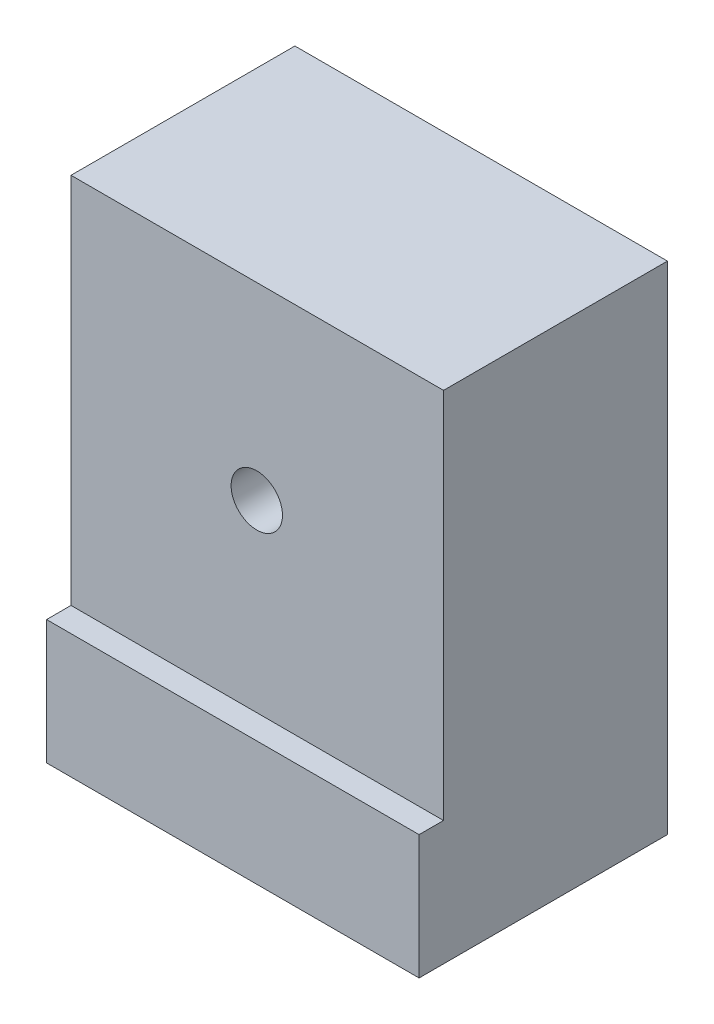
ISO-10303-21;
HEADER;
FILE_DESCRIPTION(('STEP AP214'),'2;1');
FILE_NAME('part.step','',(''),(''),'','','');
FILE_SCHEMA(('AUTOMOTIVE_DESIGN { 1 0 10303 214 1 1 1 1 }'));
ENDSEC;
DATA;
#1=APPLICATION_CONTEXT('core data for automotive mechanical design processes');
#2=APPLICATION_PROTOCOL_DEFINITION('international standard','automotive_design',2000,#1);
#3=PRODUCT_CONTEXT('',#1,'mechanical');
#4=PRODUCT('Part','Part','',(#3));
#5=PRODUCT_RELATED_PRODUCT_CATEGORY('part','',(#4));
#6=PRODUCT_DEFINITION_FORMATION('','',#4);
#7=PRODUCT_DEFINITION_CONTEXT('part definition',#1,'design');
#8=PRODUCT_DEFINITION('design','',#6,#7);
#9=PRODUCT_DEFINITION_SHAPE('','',#8);
#10=(LENGTH_UNIT() NAMED_UNIT(*) SI_UNIT(.MILLI.,.METRE.));
#11=(NAMED_UNIT(*) PLANE_ANGLE_UNIT() SI_UNIT($,.RADIAN.));
#12=(NAMED_UNIT(*) SI_UNIT($,.STERADIAN.) SOLID_ANGLE_UNIT());
#13=UNCERTAINTY_MEASURE_WITH_UNIT(LENGTH_MEASURE(1.E-05),#10,'distance_accuracy_value','');
#14=(GEOMETRIC_REPRESENTATION_CONTEXT(3) GLOBAL_UNCERTAINTY_ASSIGNED_CONTEXT((#13)) GLOBAL_UNIT_ASSIGNED_CONTEXT((#10,
#11,#12)) REPRESENTATION_CONTEXT('',''));
#15=CARTESIAN_POINT('',(0.,0.,0.));
#16=DIRECTION('',(0.,0.,1.));
#17=DIRECTION('',(1.,0.,0.));
#18=AXIS2_PLACEMENT_3D('',#15,#16,#17);
#19=CARTESIAN_POINT('',(0.,101.6,-50.8));
#20=DIRECTION('',(0.,-1.,0.));
#21=DIRECTION('',(0.,0.,-1.));
#22=AXIS2_PLACEMENT_3D('',#19,#20,#21);
#23=PLANE('',#22);
#24=DIRECTION('',(-1.,0.,0.));
#25=VECTOR('',#24,1.);
#26=CARTESIAN_POINT('',(0.,101.6,-5.));
#27=LINE('',#26,#25);
#28=CARTESIAN_POINT('',(76.2,101.6,-5.));
#29=VERTEX_POINT('',#28);
#30=CARTESIAN_POINT('',(0.,101.6,-5.));
#31=VERTEX_POINT('',#30);
#32=EDGE_CURVE('E138',#29,#31,#27,.T.);
#33=ORIENTED_EDGE('',*,*,#32,.F.);
#34=DIRECTION('',(0.,0.,-1.));
#35=VECTOR('',#34,1.);
#36=CARTESIAN_POINT('',(76.2,101.6,0.));
#37=LINE('',#36,#35);
#38=CARTESIAN_POINT('',(76.2,101.6,-50.8));
#39=VERTEX_POINT('',#38);
#40=EDGE_CURVE('E146',#29,#39,#37,.T.);
#41=ORIENTED_EDGE('',*,*,#40,.T.);
#42=DIRECTION('',(-1.,0.,0.));
#43=VECTOR('',#42,1.);
#44=CARTESIAN_POINT('',(0.,101.6,-50.8));
#45=LINE('',#44,#43);
#46=CARTESIAN_POINT('',(0.,101.6,-50.8));
#47=VERTEX_POINT('',#46);
#48=EDGE_CURVE('E57',#39,#47,#45,.T.);
#49=ORIENTED_EDGE('',*,*,#48,.T.);
#50=DIRECTION('',(0.,0.,1.));
#51=VECTOR('',#50,1.);
#52=CARTESIAN_POINT('',(0.,101.6,0.));
#53=LINE('',#52,#51);
#54=EDGE_CURVE('E85',#47,#31,#53,.T.);
#55=ORIENTED_EDGE('',*,*,#54,.T.);
#56=EDGE_LOOP('',(#33,#41,#49,#55));
#57=FACE_BOUND('',#56,.T.);
#58=ADVANCED_FACE('F31',(#57),#23,.F.);
#59=CARTESIAN_POINT('',(38.,63.,-300.));
#60=DIRECTION('',(0.,0.,1.));
#61=DIRECTION('',(1.,0.,0.));
#62=AXIS2_PLACEMENT_3D('',#59,#60,#61);
#63=CYLINDRICAL_SURFACE('',#62,5.25);
#64=CARTESIAN_POINT('',(38.,63.,-50.8));
#65=DIRECTION('',(0.,0.,1.));
#66=DIRECTION('',(1.,0.,0.));
#67=AXIS2_PLACEMENT_3D('',#64,#65,#66);
#68=CIRCLE('',#67,5.25);
#69=CARTESIAN_POINT('',(43.25,63.,-50.8));
#70=VERTEX_POINT('',#69);
#71=EDGE_CURVE('E98',#70,#70,#68,.T.);
#72=ORIENTED_EDGE('',*,*,#71,.F.);
#73=EDGE_LOOP('',(#72));
#74=FACE_BOUND('',#73,.T.);
#75=CARTESIAN_POINT('',(38.,63.,-5.));
#76=DIRECTION('',(0.,0.,1.));
#77=DIRECTION('',(1.,0.,0.));
#78=AXIS2_PLACEMENT_3D('',#75,#76,#77);
#79=CIRCLE('',#78,5.25);
#80=CARTESIAN_POINT('',(43.25,63.,-5.));
#81=VERTEX_POINT('',#80);
#82=EDGE_CURVE('E35',#81,#81,#79,.F.);
#83=ORIENTED_EDGE('',*,*,#82,.F.);
#84=EDGE_LOOP('',(#83));
#85=FACE_BOUND('',#84,.T.);
#86=ADVANCED_FACE('F149',(#74,#85),#63,.F.);
#87=CARTESIAN_POINT('',(0.,101.6,0.));
#88=DIRECTION('',(1.,0.,0.));
#89=DIRECTION('',(0.,0.,-1.));
#90=AXIS2_PLACEMENT_3D('',#87,#88,#89);
#91=PLANE('',#90);
#92=DIRECTION('',(0.,-1.,0.));
#93=VECTOR('',#92,1.);
#94=CARTESIAN_POINT('',(0.,101.6,0.));
#95=LINE('',#94,#93);
#96=CARTESIAN_POINT('',(0.,25.4,0.));
#97=VERTEX_POINT('',#96);
#98=CARTESIAN_POINT('',(0.,0.,0.));
#99=VERTEX_POINT('',#98);
#100=EDGE_CURVE('E11',#97,#99,#95,.T.);
#101=ORIENTED_EDGE('',*,*,#100,.F.);
#102=DIRECTION('',(0.,0.,1.));
#103=VECTOR('',#102,1.);
#104=CARTESIAN_POINT('',(0.,25.4,-5.));
#105=LINE('',#104,#103);
#106=CARTESIAN_POINT('',(0.,25.4,-5.));
#107=VERTEX_POINT('',#106);
#108=EDGE_CURVE('E123',#107,#97,#105,.T.);
#109=ORIENTED_EDGE('',*,*,#108,.F.);
#110=DIRECTION('',(0.,-1.,0.));
#111=VECTOR('',#110,1.);
#112=CARTESIAN_POINT('',(0.,101.6,-5.));
#113=LINE('',#112,#111);
#114=EDGE_CURVE('E134',#31,#107,#113,.T.);
#115=ORIENTED_EDGE('',*,*,#114,.F.);
#116=ORIENTED_EDGE('',*,*,#54,.F.);
#117=DIRECTION('',(0.,-1.,0.));
#118=VECTOR('',#117,1.);
#119=CARTESIAN_POINT('',(0.,101.6,-50.8));
#120=LINE('',#119,#118);
#121=CARTESIAN_POINT('',(0.,0.,-50.8));
#122=VERTEX_POINT('',#121);
#123=EDGE_CURVE('E78',#47,#122,#120,.T.);
#124=ORIENTED_EDGE('',*,*,#123,.T.);
#125=DIRECTION('',(0.,0.,1.));
#126=VECTOR('',#125,1.);
#127=CARTESIAN_POINT('',(0.,0.,0.));
#128=LINE('',#127,#126);
#129=EDGE_CURVE('E91',#122,#99,#128,.T.);
#130=ORIENTED_EDGE('',*,*,#129,.T.);
#131=EDGE_LOOP('',(#101,#109,#115,#116,#124,#130));
#132=FACE_BOUND('',#131,.T.);
#133=ADVANCED_FACE('F33',(#132),#91,.F.);
#134=CARTESIAN_POINT('',(0.,101.6,0.));
#135=DIRECTION('',(0.,0.,-1.));
#136=DIRECTION('',(-1.,0.,0.));
#137=AXIS2_PLACEMENT_3D('',#134,#135,#136);
#138=PLANE('',#137);
#139=DIRECTION('',(0.,-1.,0.));
#140=VECTOR('',#139,1.);
#141=CARTESIAN_POINT('',(76.2,101.6,0.));
#142=LINE('',#141,#140);
#143=CARTESIAN_POINT('',(76.2,25.4,0.));
#144=VERTEX_POINT('',#143);
#145=CARTESIAN_POINT('',(76.2,0.,0.));
#146=VERTEX_POINT('',#145);
#147=EDGE_CURVE('E40',#144,#146,#142,.T.);
#148=ORIENTED_EDGE('',*,*,#147,.F.);
#149=DIRECTION('',(1.,0.,0.));
#150=VECTOR('',#149,1.);
#151=CARTESIAN_POINT('',(0.,25.4,0.));
#152=LINE('',#151,#150);
#153=EDGE_CURVE('E119',#97,#144,#152,.T.);
#154=ORIENTED_EDGE('',*,*,#153,.F.);
#155=ORIENTED_EDGE('',*,*,#100,.T.);
#156=DIRECTION('',(1.,0.,0.));
#157=VECTOR('',#156,1.);
#158=CARTESIAN_POINT('',(0.,0.,0.));
#159=LINE('',#158,#157);
#160=EDGE_CURVE('E97',#99,#146,#159,.T.);
#161=ORIENTED_EDGE('',*,*,#160,.T.);
#162=EDGE_LOOP('',(#148,#154,#155,#161));
#163=FACE_BOUND('',#162,.T.);
#164=ADVANCED_FACE('F116',(#163),#138,.F.);
#165=CARTESIAN_POINT('',(76.2,101.6,0.));
#166=DIRECTION('',(-1.,0.,0.));
#167=DIRECTION('',(0.,0.,1.));
#168=AXIS2_PLACEMENT_3D('',#165,#166,#167);
#169=PLANE('',#168);
#170=DIRECTION('',(0.,1.,0.));
#171=VECTOR('',#170,1.);
#172=CARTESIAN_POINT('',(76.2,101.6,-5.));
#173=LINE('',#172,#171);
#174=CARTESIAN_POINT('',(76.2,25.4,-5.));
#175=VERTEX_POINT('',#174);
#176=EDGE_CURVE('E48',#175,#29,#173,.T.);
#177=ORIENTED_EDGE('',*,*,#176,.F.);
#178=DIRECTION('',(0.,0.,1.));
#179=VECTOR('',#178,1.);
#180=CARTESIAN_POINT('',(76.2,25.4,-5.));
#181=LINE('',#180,#179);
#182=EDGE_CURVE('E113',#175,#144,#181,.T.);
#183=ORIENTED_EDGE('',*,*,#182,.T.);
#184=ORIENTED_EDGE('',*,*,#147,.T.);
#185=DIRECTION('',(0.,0.,-1.));
#186=VECTOR('',#185,1.);
#187=CARTESIAN_POINT('',(76.2,0.,0.));
#188=LINE('',#187,#186);
#189=CARTESIAN_POINT('',(76.2,0.,-50.8));
#190=VERTEX_POINT('',#189);
#191=EDGE_CURVE('E86',#146,#190,#188,.T.);
#192=ORIENTED_EDGE('',*,*,#191,.T.);
#193=DIRECTION('',(0.,-1.,0.));
#194=VECTOR('',#193,1.);
#195=CARTESIAN_POINT('',(76.2,101.6,-50.8));
#196=LINE('',#195,#194);
#197=EDGE_CURVE('E81',#39,#190,#196,.T.);
#198=ORIENTED_EDGE('',*,*,#197,.F.);
#199=ORIENTED_EDGE('',*,*,#40,.F.);
#200=EDGE_LOOP('',(#177,#183,#184,#192,#198,#199));
#201=FACE_BOUND('',#200,.T.);
#202=ADVANCED_FACE('F110',(#201),#169,.F.);
#203=CARTESIAN_POINT('',(0.,101.6,-50.8));
#204=DIRECTION('',(0.,0.,1.));
#205=DIRECTION('',(1.,0.,0.));
#206=AXIS2_PLACEMENT_3D('',#203,#204,#205);
#207=PLANE('',#206);
#208=ORIENTED_EDGE('',*,*,#71,.T.);
#209=EDGE_LOOP('',(#208));
#210=FACE_BOUND('',#209,.T.);
#211=DIRECTION('',(-1.,0.,0.));
#212=VECTOR('',#211,1.);
#213=CARTESIAN_POINT('',(0.,0.,-50.8));
#214=LINE('',#213,#212);
#215=EDGE_CURVE('E75',#190,#122,#214,.T.);
#216=ORIENTED_EDGE('',*,*,#215,.T.);
#217=ORIENTED_EDGE('',*,*,#123,.F.);
#218=ORIENTED_EDGE('',*,*,#48,.F.);
#219=ORIENTED_EDGE('',*,*,#197,.T.);
#220=EDGE_LOOP('',(#216,#217,#218,#219));
#221=FACE_BOUND('',#220,.T.);
#222=ADVANCED_FACE('F77',(#210,#221),#207,.F.);
#223=CARTESIAN_POINT('',(0.,0.,-50.8));
#224=DIRECTION('',(0.,-1.,0.));
#225=DIRECTION('',(0.,0.,-1.));
#226=AXIS2_PLACEMENT_3D('',#223,#224,#225);
#227=PLANE('',#226);
#228=ORIENTED_EDGE('',*,*,#129,.F.);
#229=ORIENTED_EDGE('',*,*,#215,.F.);
#230=ORIENTED_EDGE('',*,*,#191,.F.);
#231=ORIENTED_EDGE('',*,*,#160,.F.);
#232=EDGE_LOOP('',(#228,#229,#230,#231));
#233=FACE_BOUND('',#232,.T.);
#234=ADVANCED_FACE('F95',(#233),#227,.T.);
#235=CARTESIAN_POINT('',(0.,25.4,-5.));
#236=DIRECTION('',(0.,0.,1.));
#237=DIRECTION('',(1.,0.,0.));
#238=AXIS2_PLACEMENT_3D('',#235,#236,#237);
#239=PLANE('',#238);
#240=ORIENTED_EDGE('',*,*,#114,.T.);
#241=DIRECTION('',(1.,0.,0.));
#242=VECTOR('',#241,1.);
#243=CARTESIAN_POINT('',(0.,25.4,-5.));
#244=LINE('',#243,#242);
#245=EDGE_CURVE('E131',#107,#175,#244,.T.);
#246=ORIENTED_EDGE('',*,*,#245,.T.);
#247=ORIENTED_EDGE('',*,*,#176,.T.);
#248=ORIENTED_EDGE('',*,*,#32,.T.);
#249=EDGE_LOOP('',(#240,#246,#247,#248));
#250=FACE_BOUND('',#249,.T.);
#251=ORIENTED_EDGE('',*,*,#82,.T.);
#252=EDGE_LOOP('',(#251));
#253=FACE_BOUND('',#252,.T.);
#254=ADVANCED_FACE('F136',(#250,#253),#239,.T.);
#255=CARTESIAN_POINT('',(0.,25.4,-5.));
#256=DIRECTION('',(0.,-1.,0.));
#257=DIRECTION('',(0.,0.,-1.));
#258=AXIS2_PLACEMENT_3D('',#255,#256,#257);
#259=PLANE('',#258);
#260=ORIENTED_EDGE('',*,*,#153,.T.);
#261=ORIENTED_EDGE('',*,*,#182,.F.);
#262=ORIENTED_EDGE('',*,*,#245,.F.);
#263=ORIENTED_EDGE('',*,*,#108,.T.);
#264=EDGE_LOOP('',(#260,#261,#262,#263));
#265=FACE_BOUND('',#264,.T.);
#266=ADVANCED_FACE('F133',(#265),#259,.F.);
#267=CLOSED_SHELL('',(#58,#86,#133,#164,#202,#222,#234,#254,#266));
#268=MANIFOLD_SOLID_BREP('B2',#267);
#269=ADVANCED_BREP_SHAPE_REPRESENTATION('',(#18,#268),#14);
#270=SHAPE_DEFINITION_REPRESENTATION(#9,#269);
ENDSEC;
END-ISO-10303-21;
